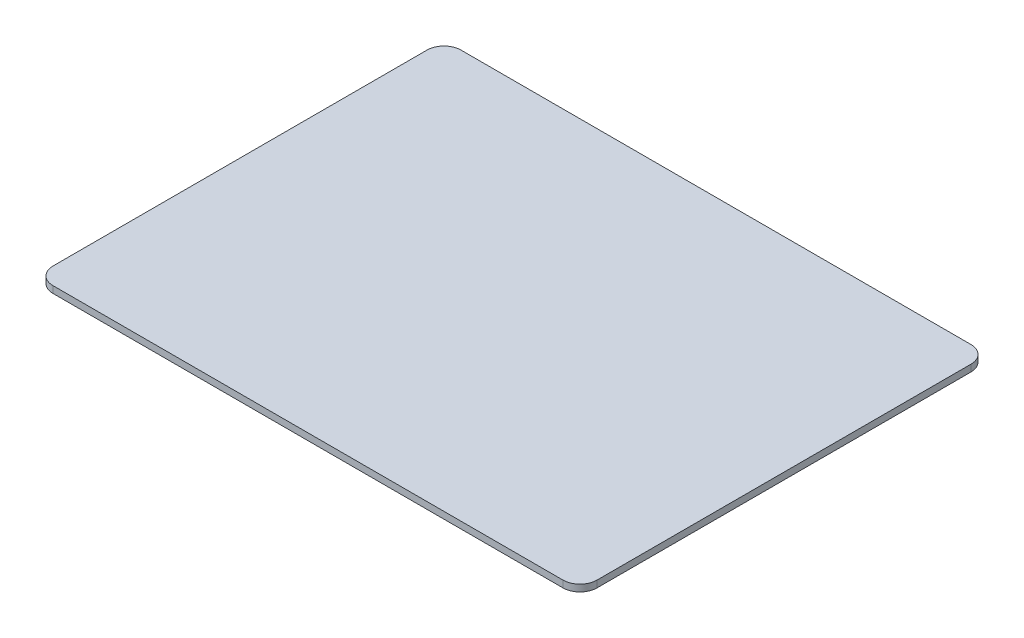
ISO-10303-21;
HEADER;
FILE_DESCRIPTION(('STEP AP214'),'2;1');
FILE_NAME('part.step','',(''),(''),'','','');
FILE_SCHEMA(('AUTOMOTIVE_DESIGN { 1 0 10303 214 1 1 1 1 }'));
ENDSEC;
DATA;
#1=APPLICATION_CONTEXT('core data for automotive mechanical design processes');
#2=APPLICATION_PROTOCOL_DEFINITION('international standard','automotive_design',2000,#1);
#3=PRODUCT_CONTEXT('',#1,'mechanical');
#4=PRODUCT('Part','Part','',(#3));
#5=PRODUCT_RELATED_PRODUCT_CATEGORY('part','',(#4));
#6=PRODUCT_DEFINITION_FORMATION('','',#4);
#7=PRODUCT_DEFINITION_CONTEXT('part definition',#1,'design');
#8=PRODUCT_DEFINITION('design','',#6,#7);
#9=PRODUCT_DEFINITION_SHAPE('','',#8);
#10=(LENGTH_UNIT() NAMED_UNIT(*) SI_UNIT(.MILLI.,.METRE.));
#11=(NAMED_UNIT(*) PLANE_ANGLE_UNIT() SI_UNIT($,.RADIAN.));
#12=(NAMED_UNIT(*) SI_UNIT($,.STERADIAN.) SOLID_ANGLE_UNIT());
#13=UNCERTAINTY_MEASURE_WITH_UNIT(LENGTH_MEASURE(1.E-05),#10,'distance_accuracy_value','');
#14=(GEOMETRIC_REPRESENTATION_CONTEXT(3) GLOBAL_UNCERTAINTY_ASSIGNED_CONTEXT((#13)) GLOBAL_UNIT_ASSIGNED_CONTEXT((#10,
#11,#12)) REPRESENTATION_CONTEXT('',''));
#15=CARTESIAN_POINT('',(0.,0.,0.));
#16=DIRECTION('',(0.,0.,1.));
#17=DIRECTION('',(1.,0.,0.));
#18=AXIS2_PLACEMENT_3D('',#15,#16,#17);
#19=CARTESIAN_POINT('',(10.,4.,-10.));
#20=DIRECTION('',(0.,-1.,0.));
#21=DIRECTION('',(0.,0.,-1.));
#22=AXIS2_PLACEMENT_3D('',#19,#20,#21);
#23=CYLINDRICAL_SURFACE('',#22,10.);
#24=CARTESIAN_POINT('',(10.,0.,-10.));
#25=DIRECTION('',(0.,1.,0.));
#26=DIRECTION('',(0.,0.,-1.));
#27=AXIS2_PLACEMENT_3D('',#24,#25,#26);
#28=CIRCLE('',#27,10.);
#29=CARTESIAN_POINT('',(0.,0.,-10.0000000000001));
#30=VERTEX_POINT('',#29);
#31=CARTESIAN_POINT('',(10.0000000000001,0.,0.));
#32=VERTEX_POINT('',#31);
#33=EDGE_CURVE('E148',#30,#32,#28,.T.);
#34=ORIENTED_EDGE('',*,*,#33,.T.);
#35=DIRECTION('',(0.,-1.,0.));
#36=VECTOR('',#35,1.);
#37=CARTESIAN_POINT('',(10.0000000000001,4.,0.));
#38=LINE('',#37,#36);
#39=CARTESIAN_POINT('',(10.0000000000001,4.,0.));
#40=VERTEX_POINT('',#39);
#41=EDGE_CURVE('E11',#40,#32,#38,.T.);
#42=ORIENTED_EDGE('',*,*,#41,.F.);
#43=CARTESIAN_POINT('',(10.,4.,-10.));
#44=DIRECTION('',(0.,1.,0.));
#45=DIRECTION('',(0.,0.,-1.));
#46=AXIS2_PLACEMENT_3D('',#43,#44,#45);
#47=CIRCLE('',#46,10.);
#48=CARTESIAN_POINT('',(0.,4.,-10.0000000000001));
#49=VERTEX_POINT('',#48);
#50=EDGE_CURVE('E170',#49,#40,#47,.T.);
#51=ORIENTED_EDGE('',*,*,#50,.F.);
#52=DIRECTION('',(0.,-1.,0.));
#53=VECTOR('',#52,1.);
#54=CARTESIAN_POINT('',(0.,4.,-10.0000000000001));
#55=LINE('',#54,#53);
#56=EDGE_CURVE('E144',#49,#30,#55,.T.);
#57=ORIENTED_EDGE('',*,*,#56,.T.);
#58=EDGE_LOOP('',(#34,#42,#51,#57));
#59=FACE_BOUND('',#58,.T.);
#60=ADVANCED_FACE('F47',(#59),#23,.T.);
#61=CARTESIAN_POINT('',(10.0000000000001,4.,0.));
#62=DIRECTION('',(0.,0.,-1.));
#63=DIRECTION('',(-1.,0.,0.));
#64=AXIS2_PLACEMENT_3D('',#61,#62,#63);
#65=PLANE('',#64);
#66=DIRECTION('',(1.,0.,0.));
#67=VECTOR('',#66,1.);
#68=CARTESIAN_POINT('',(10.0000000000001,0.,0.));
#69=LINE('',#68,#67);
#70=CARTESIAN_POINT('',(310.,0.,0.));
#71=VERTEX_POINT('',#70);
#72=EDGE_CURVE('E152',#32,#71,#69,.T.);
#73=ORIENTED_EDGE('',*,*,#72,.T.);
#74=DIRECTION('',(0.,-1.,0.));
#75=VECTOR('',#74,1.);
#76=CARTESIAN_POINT('',(310.,4.,0.));
#77=LINE('',#76,#75);
#78=CARTESIAN_POINT('',(310.,4.,0.));
#79=VERTEX_POINT('',#78);
#80=EDGE_CURVE('E56',#79,#71,#77,.T.);
#81=ORIENTED_EDGE('',*,*,#80,.F.);
#82=DIRECTION('',(1.,0.,0.));
#83=VECTOR('',#82,1.);
#84=CARTESIAN_POINT('',(10.0000000000001,4.,0.));
#85=LINE('',#84,#83);
#86=EDGE_CURVE('E107',#40,#79,#85,.T.);
#87=ORIENTED_EDGE('',*,*,#86,.F.);
#88=ORIENTED_EDGE('',*,*,#41,.T.);
#89=EDGE_LOOP('',(#73,#81,#87,#88));
#90=FACE_BOUND('',#89,.T.);
#91=ADVANCED_FACE('F216',(#90),#65,.F.);
#92=CARTESIAN_POINT('',(310.,4.,-10.));
#93=DIRECTION('',(0.,-1.,0.));
#94=DIRECTION('',(0.,0.,-1.));
#95=AXIS2_PLACEMENT_3D('',#92,#93,#94);
#96=CYLINDRICAL_SURFACE('',#95,10.);
#97=CARTESIAN_POINT('',(310.,0.,-10.));
#98=DIRECTION('',(0.,1.,0.));
#99=DIRECTION('',(0.,0.,1.));
#100=AXIS2_PLACEMENT_3D('',#97,#98,#99);
#101=CIRCLE('',#100,10.);
#102=CARTESIAN_POINT('',(320.,0.,-10.0000000000001));
#103=VERTEX_POINT('',#102);
#104=EDGE_CURVE('E155',#71,#103,#101,.T.);
#105=ORIENTED_EDGE('',*,*,#104,.T.);
#106=DIRECTION('',(0.,-1.,0.));
#107=VECTOR('',#106,1.);
#108=CARTESIAN_POINT('',(320.,4.,-10.0000000000001));
#109=LINE('',#108,#107);
#110=CARTESIAN_POINT('',(320.,4.,-10.0000000000001));
#111=VERTEX_POINT('',#110);
#112=EDGE_CURVE('E181',#111,#103,#109,.T.);
#113=ORIENTED_EDGE('',*,*,#112,.F.);
#114=CARTESIAN_POINT('',(310.,4.,-10.));
#115=DIRECTION('',(0.,1.,0.));
#116=DIRECTION('',(0.,0.,1.));
#117=AXIS2_PLACEMENT_3D('',#114,#115,#116);
#118=CIRCLE('',#117,10.);
#119=EDGE_CURVE('E191',#79,#111,#118,.T.);
#120=ORIENTED_EDGE('',*,*,#119,.F.);
#121=ORIENTED_EDGE('',*,*,#80,.T.);
#122=EDGE_LOOP('',(#105,#113,#120,#121));
#123=FACE_BOUND('',#122,.T.);
#124=ADVANCED_FACE('F189',(#123),#96,.T.);
#125=CARTESIAN_POINT('',(320.,4.,-10.0000000000001));
#126=DIRECTION('',(-1.,0.,0.));
#127=DIRECTION('',(0.,0.,1.));
#128=AXIS2_PLACEMENT_3D('',#125,#126,#127);
#129=PLANE('',#128);
#130=DIRECTION('',(0.,0.,-1.));
#131=VECTOR('',#130,1.);
#132=CARTESIAN_POINT('',(320.,0.,-10.0000000000001));
#133=LINE('',#132,#131);
#134=CARTESIAN_POINT('',(320.,0.,-230.));
#135=VERTEX_POINT('',#134);
#136=EDGE_CURVE('E158',#103,#135,#133,.T.);
#137=ORIENTED_EDGE('',*,*,#136,.T.);
#138=DIRECTION('',(0.,-1.,0.));
#139=VECTOR('',#138,1.);
#140=CARTESIAN_POINT('',(320.,4.,-230.));
#141=LINE('',#140,#139);
#142=CARTESIAN_POINT('',(320.,4.,-230.));
#143=VERTEX_POINT('',#142);
#144=EDGE_CURVE('E177',#143,#135,#141,.T.);
#145=ORIENTED_EDGE('',*,*,#144,.F.);
#146=DIRECTION('',(0.,0.,-1.));
#147=VECTOR('',#146,1.);
#148=CARTESIAN_POINT('',(320.,4.,-10.0000000000001));
#149=LINE('',#148,#147);
#150=EDGE_CURVE('E204',#111,#143,#149,.T.);
#151=ORIENTED_EDGE('',*,*,#150,.F.);
#152=ORIENTED_EDGE('',*,*,#112,.T.);
#153=EDGE_LOOP('',(#137,#145,#151,#152));
#154=FACE_BOUND('',#153,.T.);
#155=ADVANCED_FACE('F199',(#154),#129,.F.);
#156=CARTESIAN_POINT('',(310.,4.,-230.));
#157=DIRECTION('',(0.,-1.,0.));
#158=DIRECTION('',(0.,0.,-1.));
#159=AXIS2_PLACEMENT_3D('',#156,#157,#158);
#160=CYLINDRICAL_SURFACE('',#159,10.);
#161=CARTESIAN_POINT('',(310.,0.,-230.));
#162=DIRECTION('',(0.,1.,0.));
#163=DIRECTION('',(0.,0.,-1.));
#164=AXIS2_PLACEMENT_3D('',#161,#162,#163);
#165=CIRCLE('',#164,10.);
#166=CARTESIAN_POINT('',(310.,0.,-240.));
#167=VERTEX_POINT('',#166);
#168=EDGE_CURVE('E161',#135,#167,#165,.T.);
#169=ORIENTED_EDGE('',*,*,#168,.T.);
#170=DIRECTION('',(0.,-1.,0.));
#171=VECTOR('',#170,1.);
#172=CARTESIAN_POINT('',(310.,4.,-240.));
#173=LINE('',#172,#171);
#174=CARTESIAN_POINT('',(310.,4.,-240.));
#175=VERTEX_POINT('',#174);
#176=EDGE_CURVE('E137',#175,#167,#173,.T.);
#177=ORIENTED_EDGE('',*,*,#176,.F.);
#178=CARTESIAN_POINT('',(310.,4.,-230.));
#179=DIRECTION('',(0.,1.,0.));
#180=DIRECTION('',(0.,0.,-1.));
#181=AXIS2_PLACEMENT_3D('',#178,#179,#180);
#182=CIRCLE('',#181,10.);
#183=EDGE_CURVE('E126',#143,#175,#182,.T.);
#184=ORIENTED_EDGE('',*,*,#183,.F.);
#185=ORIENTED_EDGE('',*,*,#144,.T.);
#186=EDGE_LOOP('',(#169,#177,#184,#185));
#187=FACE_BOUND('',#186,.T.);
#188=ADVANCED_FACE('F202',(#187),#160,.T.);
#189=CARTESIAN_POINT('',(10.0000000000001,4.,-240.));
#190=DIRECTION('',(0.,0.,1.));
#191=DIRECTION('',(1.,0.,0.));
#192=AXIS2_PLACEMENT_3D('',#189,#190,#191);
#193=PLANE('',#192);
#194=DIRECTION('',(-1.,0.,0.));
#195=VECTOR('',#194,1.);
#196=CARTESIAN_POINT('',(10.0000000000001,0.,-240.));
#197=LINE('',#196,#195);
#198=CARTESIAN_POINT('',(10.0000000000001,0.,-240.));
#199=VERTEX_POINT('',#198);
#200=EDGE_CURVE('E135',#167,#199,#197,.T.);
#201=ORIENTED_EDGE('',*,*,#200,.T.);
#202=DIRECTION('',(0.,-1.,0.));
#203=VECTOR('',#202,1.);
#204=CARTESIAN_POINT('',(10.0000000000001,4.,-240.));
#205=LINE('',#204,#203);
#206=CARTESIAN_POINT('',(10.0000000000001,4.,-240.));
#207=VERTEX_POINT('',#206);
#208=EDGE_CURVE('E132',#207,#199,#205,.T.);
#209=ORIENTED_EDGE('',*,*,#208,.F.);
#210=DIRECTION('',(-1.,0.,0.));
#211=VECTOR('',#210,1.);
#212=CARTESIAN_POINT('',(10.0000000000001,4.,-240.));
#213=LINE('',#212,#211);
#214=EDGE_CURVE('E120',#175,#207,#213,.T.);
#215=ORIENTED_EDGE('',*,*,#214,.F.);
#216=ORIENTED_EDGE('',*,*,#176,.T.);
#217=EDGE_LOOP('',(#201,#209,#215,#216));
#218=FACE_BOUND('',#217,.T.);
#219=ADVANCED_FACE('F133',(#218),#193,.F.);
#220=CARTESIAN_POINT('',(10.,4.,-230.));
#221=DIRECTION('',(0.,-1.,0.));
#222=DIRECTION('',(0.,0.,-1.));
#223=AXIS2_PLACEMENT_3D('',#220,#221,#222);
#224=CYLINDRICAL_SURFACE('',#223,10.);
#225=CARTESIAN_POINT('',(10.,0.,-230.));
#226=DIRECTION('',(0.,1.,0.));
#227=DIRECTION('',(0.,0.,-1.));
#228=AXIS2_PLACEMENT_3D('',#225,#226,#227);
#229=CIRCLE('',#228,10.);
#230=CARTESIAN_POINT('',(0.,0.,-230.));
#231=VERTEX_POINT('',#230);
#232=EDGE_CURVE('E93',#199,#231,#229,.T.);
#233=ORIENTED_EDGE('',*,*,#232,.T.);
#234=DIRECTION('',(0.,-1.,0.));
#235=VECTOR('',#234,1.);
#236=CARTESIAN_POINT('',(0.,4.,-230.));
#237=LINE('',#236,#235);
#238=CARTESIAN_POINT('',(0.,4.,-230.));
#239=VERTEX_POINT('',#238);
#240=EDGE_CURVE('E138',#239,#231,#237,.T.);
#241=ORIENTED_EDGE('',*,*,#240,.F.);
#242=CARTESIAN_POINT('',(10.,4.,-230.));
#243=DIRECTION('',(0.,1.,0.));
#244=DIRECTION('',(0.,0.,-1.));
#245=AXIS2_PLACEMENT_3D('',#242,#243,#244);
#246=CIRCLE('',#245,10.);
#247=EDGE_CURVE('E124',#207,#239,#246,.T.);
#248=ORIENTED_EDGE('',*,*,#247,.F.);
#249=ORIENTED_EDGE('',*,*,#208,.T.);
#250=EDGE_LOOP('',(#233,#241,#248,#249));
#251=FACE_BOUND('',#250,.T.);
#252=ADVANCED_FACE('F140',(#251),#224,.T.);
#253=CARTESIAN_POINT('',(0.,4.,-10.0000000000001));
#254=DIRECTION('',(1.,0.,0.));
#255=DIRECTION('',(0.,0.,-1.));
#256=AXIS2_PLACEMENT_3D('',#253,#254,#255);
#257=PLANE('',#256);
#258=DIRECTION('',(0.,0.,1.));
#259=VECTOR('',#258,1.);
#260=CARTESIAN_POINT('',(0.,0.,-10.0000000000001));
#261=LINE('',#260,#259);
#262=EDGE_CURVE('E99',#231,#30,#261,.T.);
#263=ORIENTED_EDGE('',*,*,#262,.T.);
#264=ORIENTED_EDGE('',*,*,#56,.F.);
#265=DIRECTION('',(0.,0.,1.));
#266=VECTOR('',#265,1.);
#267=CARTESIAN_POINT('',(0.,4.,-10.0000000000001));
#268=LINE('',#267,#266);
#269=EDGE_CURVE('E64',#239,#49,#268,.T.);
#270=ORIENTED_EDGE('',*,*,#269,.F.);
#271=ORIENTED_EDGE('',*,*,#240,.T.);
#272=EDGE_LOOP('',(#263,#264,#270,#271));
#273=FACE_BOUND('',#272,.T.);
#274=ADVANCED_FACE('F232',(#273),#257,.F.);
#275=CARTESIAN_POINT('',(10.,4.,-10.));
#276=DIRECTION('',(0.,-1.,0.));
#277=DIRECTION('',(0.,0.,-1.));
#278=AXIS2_PLACEMENT_3D('',#275,#276,#277);
#279=PLANE('',#278);
#280=ORIENTED_EDGE('',*,*,#50,.T.);
#281=ORIENTED_EDGE('',*,*,#86,.T.);
#282=ORIENTED_EDGE('',*,*,#119,.T.);
#283=ORIENTED_EDGE('',*,*,#150,.T.);
#284=ORIENTED_EDGE('',*,*,#183,.T.);
#285=ORIENTED_EDGE('',*,*,#214,.T.);
#286=ORIENTED_EDGE('',*,*,#247,.T.);
#287=ORIENTED_EDGE('',*,*,#269,.T.);
#288=EDGE_LOOP('',(#280,#281,#282,#283,#284,#285,#286,#287));
#289=FACE_BOUND('',#288,.T.);
#290=ADVANCED_FACE('F122',(#289),#279,.F.);
#291=CARTESIAN_POINT('',(10.,0.,-10.));
#292=DIRECTION('',(0.,-1.,0.));
#293=DIRECTION('',(0.,0.,-1.));
#294=AXIS2_PLACEMENT_3D('',#291,#292,#293);
#295=PLANE('',#294);
#296=ORIENTED_EDGE('',*,*,#33,.F.);
#297=ORIENTED_EDGE('',*,*,#262,.F.);
#298=ORIENTED_EDGE('',*,*,#232,.F.);
#299=ORIENTED_EDGE('',*,*,#200,.F.);
#300=ORIENTED_EDGE('',*,*,#168,.F.);
#301=ORIENTED_EDGE('',*,*,#136,.F.);
#302=ORIENTED_EDGE('',*,*,#104,.F.);
#303=ORIENTED_EDGE('',*,*,#72,.F.);
#304=EDGE_LOOP('',(#296,#297,#298,#299,#300,#301,#302,#303));
#305=FACE_BOUND('',#304,.T.);
#306=ADVANCED_FACE('F195',(#305),#295,.T.);
#307=CLOSED_SHELL('',(#60,#91,#124,#155,#188,#219,#252,#274,#290,#306));
#308=MANIFOLD_SOLID_BREP('B2',#307);
#309=ADVANCED_BREP_SHAPE_REPRESENTATION('',(#18,#308),#14);
#310=SHAPE_DEFINITION_REPRESENTATION(#9,#309);
ENDSEC;
END-ISO-10303-21;
